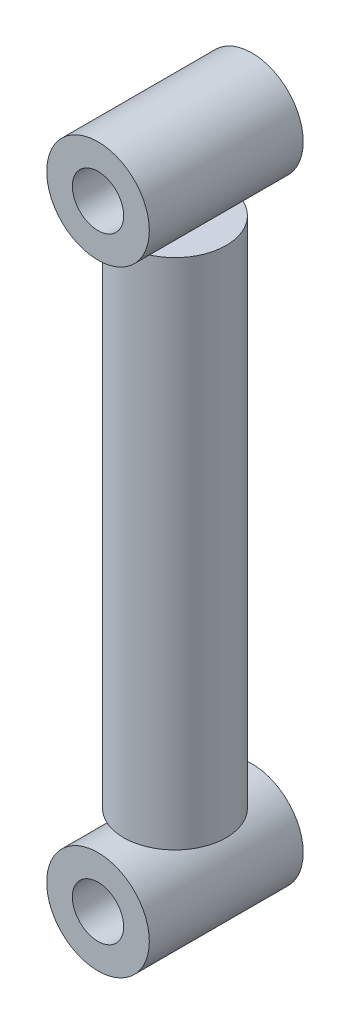
ISO-10303-21;
HEADER;
FILE_DESCRIPTION(('STEP AP214'),'2;1');
FILE_NAME('part.step','',(''),(''),'','','');
FILE_SCHEMA(('AUTOMOTIVE_DESIGN { 1 0 10303 214 1 1 1 1 }'));
ENDSEC;
DATA;
#1=APPLICATION_CONTEXT('core data for automotive mechanical design processes');
#2=APPLICATION_PROTOCOL_DEFINITION('international standard','automotive_design',2000,#1);
#3=PRODUCT_CONTEXT('',#1,'mechanical');
#4=PRODUCT('Part','Part','',(#3));
#5=PRODUCT_RELATED_PRODUCT_CATEGORY('part','',(#4));
#6=PRODUCT_DEFINITION_FORMATION('','',#4);
#7=PRODUCT_DEFINITION_CONTEXT('part definition',#1,'design');
#8=PRODUCT_DEFINITION('design','',#6,#7);
#9=PRODUCT_DEFINITION_SHAPE('','',#8);
#10=(LENGTH_UNIT() NAMED_UNIT(*) SI_UNIT(.MILLI.,.METRE.));
#11=(NAMED_UNIT(*) PLANE_ANGLE_UNIT() SI_UNIT($,.RADIAN.));
#12=(NAMED_UNIT(*) SI_UNIT($,.STERADIAN.) SOLID_ANGLE_UNIT());
#13=UNCERTAINTY_MEASURE_WITH_UNIT(LENGTH_MEASURE(1.E-05),#10,'distance_accuracy_value','');
#14=(GEOMETRIC_REPRESENTATION_CONTEXT(3) GLOBAL_UNCERTAINTY_ASSIGNED_CONTEXT((#13)) GLOBAL_UNIT_ASSIGNED_CONTEXT((#10,
#11,#12)) REPRESENTATION_CONTEXT('',''));
#15=CARTESIAN_POINT('',(0.,0.,0.));
#16=DIRECTION('',(0.,0.,1.));
#17=DIRECTION('',(1.,0.,0.));
#18=AXIS2_PLACEMENT_3D('',#15,#16,#17);
#19=CARTESIAN_POINT('',(0.,-25.4,38.1));
#20=DIRECTION('',(0.,0.,-1.));
#21=DIRECTION('',(-1.,0.,0.));
#22=AXIS2_PLACEMENT_3D('',#19,#20,#21);
#23=CYLINDRICAL_SURFACE('',#22,25.4);
#24=CARTESIAN_POINT('',(0.,-25.4,38.1));
#25=DIRECTION('',(0.,0.,1.));
#26=DIRECTION('',(1.,0.,0.));
#27=AXIS2_PLACEMENT_3D('',#24,#25,#26);
#28=CIRCLE('',#27,25.4);
#29=CARTESIAN_POINT('',(25.4,-25.4,38.1));
#30=VERTEX_POINT('',#29);
#31=EDGE_CURVE('E11',#30,#30,#28,.T.);
#32=ORIENTED_EDGE('',*,*,#31,.F.);
#33=EDGE_LOOP('',(#32));
#34=FACE_BOUND('',#33,.T.);
#35=CARTESIAN_POINT('',(0.,-25.4,-38.1));
#36=DIRECTION('',(0.,0.,1.));
#37=DIRECTION('',(1.,0.,0.));
#38=AXIS2_PLACEMENT_3D('',#35,#36,#37);
#39=CIRCLE('',#38,25.4);
#40=CARTESIAN_POINT('',(25.4,-25.4,-38.1));
#41=VERTEX_POINT('',#40);
#42=EDGE_CURVE('E45',#41,#41,#39,.T.);
#43=ORIENTED_EDGE('',*,*,#42,.T.);
#44=EDGE_LOOP('',(#43));
#45=FACE_BOUND('',#44,.T.);
#46=ADVANCED_FACE('F42',(#34,#45),#23,.T.);
#47=CARTESIAN_POINT('',(0.,-25.4,38.1));
#48=DIRECTION('',(0.,0.,1.));
#49=DIRECTION('',(1.,0.,0.));
#50=AXIS2_PLACEMENT_3D('',#47,#48,#49);
#51=PLANE('',#50);
#52=CARTESIAN_POINT('',(0.,-25.4,38.1));
#53=DIRECTION('',(0.,0.,1.));
#54=DIRECTION('',(1.,0.,0.));
#55=AXIS2_PLACEMENT_3D('',#52,#53,#54);
#56=CIRCLE('',#55,12.7);
#57=CARTESIAN_POINT('',(12.7,-25.4,38.1));
#58=VERTEX_POINT('',#57);
#59=EDGE_CURVE('E54',#58,#58,#56,.T.);
#60=ORIENTED_EDGE('',*,*,#59,.F.);
#61=EDGE_LOOP('',(#60));
#62=FACE_BOUND('',#61,.T.);
#63=ORIENTED_EDGE('',*,*,#31,.T.);
#64=EDGE_LOOP('',(#63));
#65=FACE_BOUND('',#64,.T.);
#66=ADVANCED_FACE('F69',(#62,#65),#51,.T.);
#67=CARTESIAN_POINT('',(0.,-25.4,-38.1));
#68=DIRECTION('',(0.,0.,1.));
#69=DIRECTION('',(1.,0.,0.));
#70=AXIS2_PLACEMENT_3D('',#67,#68,#69);
#71=PLANE('',#70);
#72=CARTESIAN_POINT('',(0.,-25.4,-38.1));
#73=DIRECTION('',(0.,0.,1.));
#74=DIRECTION('',(1.,0.,0.));
#75=AXIS2_PLACEMENT_3D('',#72,#73,#74);
#76=CIRCLE('',#75,12.7);
#77=CARTESIAN_POINT('',(12.7,-25.4,-38.1));
#78=VERTEX_POINT('',#77);
#79=EDGE_CURVE('E52',#78,#78,#76,.T.);
#80=ORIENTED_EDGE('',*,*,#79,.T.);
#81=EDGE_LOOP('',(#80));
#82=FACE_BOUND('',#81,.T.);
#83=ORIENTED_EDGE('',*,*,#42,.F.);
#84=EDGE_LOOP('',(#83));
#85=FACE_BOUND('',#84,.T.);
#86=ADVANCED_FACE('F60',(#82,#85),#71,.F.);
#87=CARTESIAN_POINT('',(0.,-25.4,-38.1));
#88=DIRECTION('',(0.,0.,1.));
#89=DIRECTION('',(1.,0.,0.));
#90=AXIS2_PLACEMENT_3D('',#87,#88,#89);
#91=CYLINDRICAL_SURFACE('',#90,12.7);
#92=ORIENTED_EDGE('',*,*,#79,.F.);
#93=EDGE_LOOP('',(#92));
#94=FACE_BOUND('',#93,.T.);
#95=ORIENTED_EDGE('',*,*,#59,.T.);
#96=EDGE_LOOP('',(#95));
#97=FACE_BOUND('',#96,.T.);
#98=ADVANCED_FACE('F63',(#94,#97),#91,.F.);
#99=CLOSED_SHELL('',(#46,#66,#86,#98));
#100=MANIFOLD_SOLID_BREP('B2',#99);
#101=CARTESIAN_POINT('',(0.,279.4,38.1));
#102=DIRECTION('',(0.,0.,-1.));
#103=DIRECTION('',(-1.,0.,0.));
#104=AXIS2_PLACEMENT_3D('',#101,#102,#103);
#105=CYLINDRICAL_SURFACE('',#104,25.4);
#106=CARTESIAN_POINT('',(0.,279.4,38.1));
#107=DIRECTION('',(0.,0.,1.));
#108=DIRECTION('',(1.,0.,0.));
#109=AXIS2_PLACEMENT_3D('',#106,#107,#108);
#110=CIRCLE('',#109,25.4);
#111=CARTESIAN_POINT('',(25.4,279.4,38.1));
#112=VERTEX_POINT('',#111);
#113=EDGE_CURVE('E41',#112,#112,#110,.T.);
#114=ORIENTED_EDGE('',*,*,#113,.F.);
#115=EDGE_LOOP('',(#114));
#116=FACE_BOUND('',#115,.T.);
#117=CARTESIAN_POINT('',(0.,279.4,-38.1));
#118=DIRECTION('',(0.,0.,1.));
#119=DIRECTION('',(1.,0.,0.));
#120=AXIS2_PLACEMENT_3D('',#117,#118,#119);
#121=CIRCLE('',#120,25.4);
#122=CARTESIAN_POINT('',(25.4,279.4,-38.1));
#123=VERTEX_POINT('',#122);
#124=EDGE_CURVE('E114',#123,#123,#121,.T.);
#125=ORIENTED_EDGE('',*,*,#124,.T.);
#126=EDGE_LOOP('',(#125));
#127=FACE_BOUND('',#126,.T.);
#128=ADVANCED_FACE('F111',(#116,#127),#105,.T.);
#129=CARTESIAN_POINT('',(0.,279.4,38.1));
#130=DIRECTION('',(0.,0.,1.));
#131=DIRECTION('',(1.,0.,0.));
#132=AXIS2_PLACEMENT_3D('',#129,#130,#131);
#133=PLANE('',#132);
#134=CARTESIAN_POINT('',(0.,279.4,38.1));
#135=DIRECTION('',(0.,0.,1.));
#136=DIRECTION('',(1.,0.,0.));
#137=AXIS2_PLACEMENT_3D('',#134,#135,#136);
#138=CIRCLE('',#137,12.7);
#139=CARTESIAN_POINT('',(12.7,279.4,38.1));
#140=VERTEX_POINT('',#139);
#141=EDGE_CURVE('E123',#140,#140,#138,.T.);
#142=ORIENTED_EDGE('',*,*,#141,.F.);
#143=EDGE_LOOP('',(#142));
#144=FACE_BOUND('',#143,.T.);
#145=ORIENTED_EDGE('',*,*,#113,.T.);
#146=EDGE_LOOP('',(#145));
#147=FACE_BOUND('',#146,.T.);
#148=ADVANCED_FACE('F138',(#144,#147),#133,.T.);
#149=CARTESIAN_POINT('',(0.,279.4,-38.1));
#150=DIRECTION('',(0.,0.,1.));
#151=DIRECTION('',(1.,0.,0.));
#152=AXIS2_PLACEMENT_3D('',#149,#150,#151);
#153=PLANE('',#152);
#154=CARTESIAN_POINT('',(0.,279.4,-38.1));
#155=DIRECTION('',(0.,0.,1.));
#156=DIRECTION('',(1.,0.,0.));
#157=AXIS2_PLACEMENT_3D('',#154,#155,#156);
#158=CIRCLE('',#157,12.7);
#159=CARTESIAN_POINT('',(12.7,279.4,-38.1));
#160=VERTEX_POINT('',#159);
#161=EDGE_CURVE('E121',#160,#160,#158,.T.);
#162=ORIENTED_EDGE('',*,*,#161,.T.);
#163=EDGE_LOOP('',(#162));
#164=FACE_BOUND('',#163,.T.);
#165=ORIENTED_EDGE('',*,*,#124,.F.);
#166=EDGE_LOOP('',(#165));
#167=FACE_BOUND('',#166,.T.);
#168=ADVANCED_FACE('F129',(#164,#167),#153,.F.);
#169=CARTESIAN_POINT('',(0.,279.4,-38.1));
#170=DIRECTION('',(0.,0.,1.));
#171=DIRECTION('',(1.,0.,0.));
#172=AXIS2_PLACEMENT_3D('',#169,#170,#171);
#173=CYLINDRICAL_SURFACE('',#172,12.7);
#174=ORIENTED_EDGE('',*,*,#161,.F.);
#175=EDGE_LOOP('',(#174));
#176=FACE_BOUND('',#175,.T.);
#177=ORIENTED_EDGE('',*,*,#141,.T.);
#178=EDGE_LOOP('',(#177));
#179=FACE_BOUND('',#178,.T.);
#180=ADVANCED_FACE('F132',(#176,#179),#173,.F.);
#181=CLOSED_SHELL('',(#128,#148,#168,#180));
#182=MANIFOLD_SOLID_BREP('B6',#181);
#183=CARTESIAN_POINT('',(0.,254.,0.));
#184=DIRECTION('',(0.,-1.,0.));
#185=DIRECTION('',(0.,0.,-1.));
#186=AXIS2_PLACEMENT_3D('',#183,#184,#185);
#187=CYLINDRICAL_SURFACE('',#186,25.4);
#188=CARTESIAN_POINT('',(0.,254.,0.));
#189=DIRECTION('',(0.,1.,0.));
#190=DIRECTION('',(0.,0.,1.));
#191=AXIS2_PLACEMENT_3D('',#188,#189,#190);
#192=CIRCLE('',#191,25.4);
#193=CARTESIAN_POINT('',(0.,254.,25.4));
#194=VERTEX_POINT('',#193);
#195=EDGE_CURVE('E110',#194,#194,#192,.T.);
#196=ORIENTED_EDGE('',*,*,#195,.F.);
#197=EDGE_LOOP('',(#196));
#198=FACE_BOUND('',#197,.T.);
#199=CARTESIAN_POINT('',(0.,0.,0.));
#200=DIRECTION('',(0.,1.,0.));
#201=DIRECTION('',(0.,0.,1.));
#202=AXIS2_PLACEMENT_3D('',#199,#200,#201);
#203=CIRCLE('',#202,25.4);
#204=CARTESIAN_POINT('',(0.,0.,25.4));
#205=VERTEX_POINT('',#204);
#206=EDGE_CURVE('E176',#205,#205,#203,.T.);
#207=ORIENTED_EDGE('',*,*,#206,.T.);
#208=EDGE_LOOP('',(#207));
#209=FACE_BOUND('',#208,.T.);
#210=ADVANCED_FACE('F173',(#198,#209),#187,.T.);
#211=CARTESIAN_POINT('',(0.,254.,0.));
#212=DIRECTION('',(0.,1.,0.));
#213=DIRECTION('',(0.,0.,1.));
#214=AXIS2_PLACEMENT_3D('',#211,#212,#213);
#215=PLANE('',#214);
#216=ORIENTED_EDGE('',*,*,#195,.T.);
#217=EDGE_LOOP('',(#216));
#218=FACE_BOUND('',#217,.T.);
#219=ADVANCED_FACE('F188',(#218),#215,.T.);
#220=CARTESIAN_POINT('',(0.,0.,0.));
#221=DIRECTION('',(0.,1.,0.));
#222=DIRECTION('',(0.,0.,1.));
#223=AXIS2_PLACEMENT_3D('',#220,#221,#222);
#224=PLANE('',#223);
#225=ORIENTED_EDGE('',*,*,#206,.F.);
#226=EDGE_LOOP('',(#225));
#227=FACE_BOUND('',#226,.T.);
#228=ADVANCED_FACE('F186',(#227),#224,.F.);
#229=CLOSED_SHELL('',(#210,#219,#228));
#230=MANIFOLD_SOLID_BREP('B36',#229);
#231=ADVANCED_BREP_SHAPE_REPRESENTATION('',(#18,#100,#182,#230),#14);
#232=SHAPE_DEFINITION_REPRESENTATION(#9,#231);
ENDSEC;
END-ISO-10303-21;
